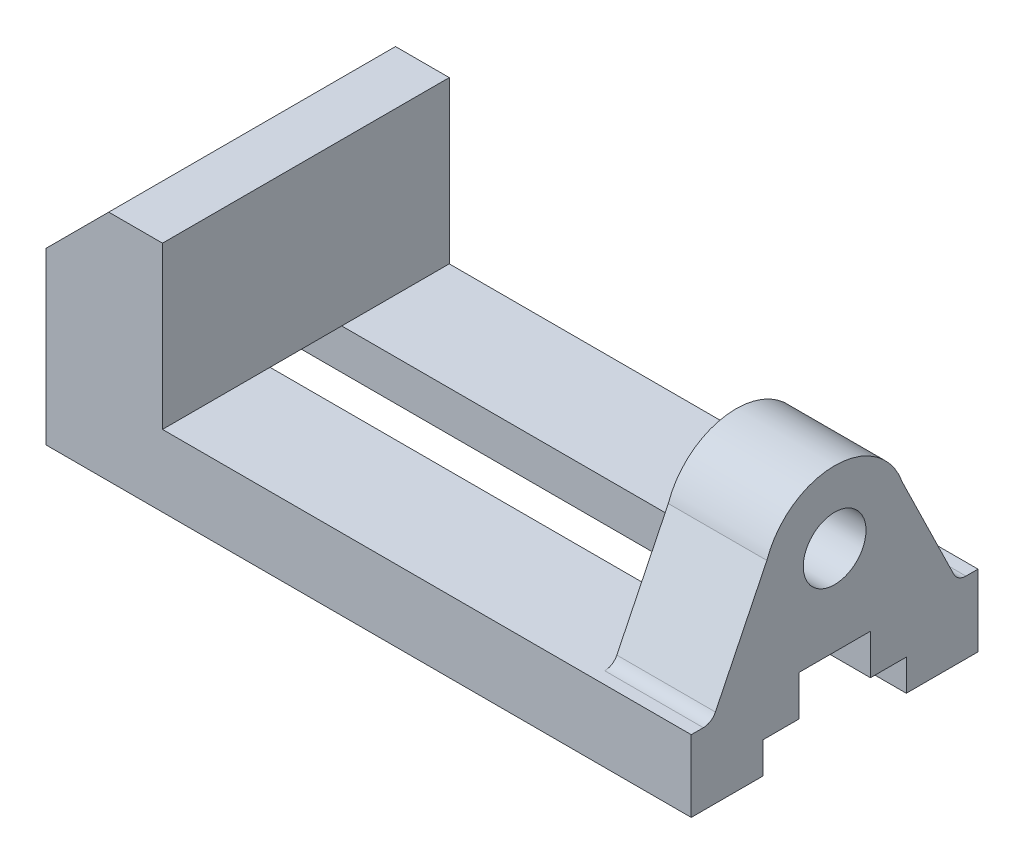
ISO-10303-21;
HEADER;
FILE_DESCRIPTION(('STEP AP214'),'2;1');
FILE_NAME('part.step','',(''),(''),'','','');
FILE_SCHEMA(('AUTOMOTIVE_DESIGN { 1 0 10303 214 1 1 1 1 }'));
ENDSEC;
DATA;
#1=APPLICATION_CONTEXT('core data for automotive mechanical design processes');
#2=APPLICATION_PROTOCOL_DEFINITION('international standard','automotive_design',2000,#1);
#3=PRODUCT_CONTEXT('',#1,'mechanical');
#4=PRODUCT('Part','Part','',(#3));
#5=PRODUCT_RELATED_PRODUCT_CATEGORY('part','',(#4));
#6=PRODUCT_DEFINITION_FORMATION('','',#4);
#7=PRODUCT_DEFINITION_CONTEXT('part definition',#1,'design');
#8=PRODUCT_DEFINITION('design','',#6,#7);
#9=PRODUCT_DEFINITION_SHAPE('','',#8);
#10=(LENGTH_UNIT() NAMED_UNIT(*) SI_UNIT(.MILLI.,.METRE.));
#11=(NAMED_UNIT(*) PLANE_ANGLE_UNIT() SI_UNIT($,.RADIAN.));
#12=(NAMED_UNIT(*) SI_UNIT($,.STERADIAN.) SOLID_ANGLE_UNIT());
#13=UNCERTAINTY_MEASURE_WITH_UNIT(LENGTH_MEASURE(1.E-05),#10,'distance_accuracy_value','');
#14=(GEOMETRIC_REPRESENTATION_CONTEXT(3) GLOBAL_UNCERTAINTY_ASSIGNED_CONTEXT((#13)) GLOBAL_UNIT_ASSIGNED_CONTEXT((#10,
#11,#12)) REPRESENTATION_CONTEXT('',''));
#15=CARTESIAN_POINT('',(0.,0.,0.));
#16=DIRECTION('',(0.,0.,1.));
#17=DIRECTION('',(1.,0.,0.));
#18=AXIS2_PLACEMENT_3D('',#15,#16,#17);
#19=CARTESIAN_POINT('',(71.2697768762677,16.,32.0551724137931));
#20=DIRECTION('',(-1.,0.,0.));
#21=DIRECTION('',(0.,0.,1.));
#22=AXIS2_PLACEMENT_3D('',#19,#20,#21);
#23=PLANE('',#22);
#24=DIRECTION('',(0.,0.,-1.));
#25=VECTOR('',#24,1.);
#26=CARTESIAN_POINT('',(71.2697768762677,16.,0.));
#27=LINE('',#26,#25);
#28=CARTESIAN_POINT('',(71.2697768762677,16.,-29.2462315949759));
#29=VERTEX_POINT('',#28);
#30=CARTESIAN_POINT('',(71.2697768762677,16.,-31.9448275862069));
#31=VERTEX_POINT('',#30);
#32=EDGE_CURVE('E248',#29,#31,#27,.T.);
#33=ORIENTED_EDGE('',*,*,#32,.F.);
#34=CARTESIAN_POINT('',(71.2697768762677,19.,-29.2462315949759));
#35=DIRECTION('',(-1.,0.,0.));
#36=DIRECTION('',(0.,0.,1.));
#37=AXIS2_PLACEMENT_3D('',#34,#35,#36);
#38=CIRCLE('',#37,3.);
#39=CARTESIAN_POINT('',(71.2697768762677,17.6848865596328,-26.5498494560784));
#40=VERTEX_POINT('',#39);
#41=EDGE_CURVE('E403',#29,#40,#38,.T.);
#42=ORIENTED_EDGE('',*,*,#41,.T.);
#43=DIRECTION('',(0.,0.89879404629917,0.438371146789073));
#44=VECTOR('',#43,1.);
#45=CARTESIAN_POINT('',(71.2697768762677,13.8592750436957,-28.4157248635937));
#46=LINE('',#45,#44);
#47=CARTESIAN_POINT('',(71.2697768762677,41.2315615862091,-15.0653686932474));
#48=VERTEX_POINT('',#47);
#49=EDGE_CURVE('E247',#40,#48,#46,.T.);
#50=ORIENTED_EDGE('',*,*,#49,.T.);
#51=CARTESIAN_POINT('',(71.2697768762677,36.,0.055172413793117));
#52=DIRECTION('',(1.,0.,0.));
#53=DIRECTION('',(0.,0.,-1.));
#54=AXIS2_PLACEMENT_3D('',#51,#52,#53);
#55=CIRCLE('',#54,16.);
#56=CARTESIAN_POINT('',(71.2697768762677,41.2315615862091,15.1757135208336));
#57=VERTEX_POINT('',#56);
#58=EDGE_CURVE('E260',#48,#57,#55,.T.);
#59=ORIENTED_EDGE('',*,*,#58,.T.);
#60=DIRECTION('',(0.,0.89879404629917,-0.438371146789073));
#61=VECTOR('',#60,1.);
#62=CARTESIAN_POINT('',(71.2697768762677,13.9027514990671,28.50486480706));
#63=LINE('',#62,#61);
#64=CARTESIAN_POINT('',(71.2697768762677,17.6848865596328,26.6601942836646));
#65=VERTEX_POINT('',#64);
#66=EDGE_CURVE('E254',#65,#57,#63,.T.);
#67=ORIENTED_EDGE('',*,*,#66,.F.);
#68=CARTESIAN_POINT('',(71.2697768762677,19.,29.3565764225621));
#69=DIRECTION('',(-1.,0.,0.));
#70=DIRECTION('',(0.,0.,1.));
#71=AXIS2_PLACEMENT_3D('',#68,#69,#70);
#72=CIRCLE('',#71,3.);
#73=CARTESIAN_POINT('',(71.2697768762677,16.,29.3565764225621));
#74=VERTEX_POINT('',#73);
#75=EDGE_CURVE('E48',#65,#74,#72,.T.);
#76=ORIENTED_EDGE('',*,*,#75,.T.);
#77=DIRECTION('',(0.,0.,1.));
#78=VECTOR('',#77,1.);
#79=CARTESIAN_POINT('',(71.2697768762677,16.,0.));
#80=LINE('',#79,#78);
#81=CARTESIAN_POINT('',(71.2697768762677,16.,32.0551724137931));
#82=VERTEX_POINT('',#81);
#83=EDGE_CURVE('E257',#74,#82,#80,.T.);
#84=ORIENTED_EDGE('',*,*,#83,.T.);
#85=DIRECTION('',(0.,-1.,0.));
#86=VECTOR('',#85,1.);
#87=CARTESIAN_POINT('',(71.2697768762677,16.,32.0551724137931));
#88=LINE('',#87,#86);
#89=CARTESIAN_POINT('',(71.2697768762677,0.,32.0551724137931));
#90=VERTEX_POINT('',#89);
#91=EDGE_CURVE('E354',#82,#90,#88,.T.);
#92=ORIENTED_EDGE('',*,*,#91,.T.);
#93=DIRECTION('',(0.,0.,-1.));
#94=VECTOR('',#93,1.);
#95=CARTESIAN_POINT('',(71.2697768762677,0.,32.0551724137931));
#96=LINE('',#95,#94);
#97=CARTESIAN_POINT('',(71.2697768762677,0.,16.0551724137931));
#98=VERTEX_POINT('',#97);
#99=EDGE_CURVE('E356',#90,#98,#96,.T.);
#100=ORIENTED_EDGE('',*,*,#99,.T.);
#101=DIRECTION('',(0.,-1.,0.));
#102=VECTOR('',#101,1.);
#103=CARTESIAN_POINT('',(71.2697768762677,0.,16.0551724137931));
#104=LINE('',#103,#102);
#105=CARTESIAN_POINT('',(71.2697768762677,7.,16.0551724137931));
#106=VERTEX_POINT('',#105);
#107=EDGE_CURVE('E374',#106,#98,#104,.T.);
#108=ORIENTED_EDGE('',*,*,#107,.F.);
#109=DIRECTION('',(0.,0.,1.));
#110=VECTOR('',#109,1.);
#111=CARTESIAN_POINT('',(71.2697768762677,7.,16.0551724137931));
#112=LINE('',#111,#110);
#113=CARTESIAN_POINT('',(71.2697768762677,7.,8.05517241379312));
#114=VERTEX_POINT('',#113);
#115=EDGE_CURVE('E371',#114,#106,#112,.T.);
#116=ORIENTED_EDGE('',*,*,#115,.F.);
#117=DIRECTION('',(0.,-1.,0.));
#118=VECTOR('',#117,1.);
#119=CARTESIAN_POINT('',(71.2697768762677,7.,8.05517241379312));
#120=LINE('',#119,#118);
#121=CARTESIAN_POINT('',(71.2697768762677,16.,8.05517241379312));
#122=VERTEX_POINT('',#121);
#123=EDGE_CURVE('E343',#122,#114,#120,.T.);
#124=ORIENTED_EDGE('',*,*,#123,.F.);
#125=DIRECTION('',(0.,0.,-1.));
#126=VECTOR('',#125,1.);
#127=CARTESIAN_POINT('',(71.2697768762677,16.,32.0551724137931));
#128=LINE('',#127,#126);
#129=CARTESIAN_POINT('',(71.2697768762677,16.,-7.94482758620688));
#130=VERTEX_POINT('',#129);
#131=EDGE_CURVE('E330',#122,#130,#128,.T.);
#132=ORIENTED_EDGE('',*,*,#131,.T.);
#133=DIRECTION('',(0.,1.,0.));
#134=VECTOR('',#133,1.);
#135=CARTESIAN_POINT('',(71.2697768762677,16.,-7.94482758620688));
#136=LINE('',#135,#134);
#137=CARTESIAN_POINT('',(71.2697768762677,7.,-7.94482758620688));
#138=VERTEX_POINT('',#137);
#139=EDGE_CURVE('E293',#138,#130,#136,.T.);
#140=ORIENTED_EDGE('',*,*,#139,.F.);
#141=DIRECTION('',(0.,0.,1.));
#142=VECTOR('',#141,1.);
#143=CARTESIAN_POINT('',(71.2697768762677,7.,-7.94482758620688));
#144=LINE('',#143,#142);
#145=CARTESIAN_POINT('',(71.2697768762677,7.,-15.9448275862069));
#146=VERTEX_POINT('',#145);
#147=EDGE_CURVE('E290',#146,#138,#144,.T.);
#148=ORIENTED_EDGE('',*,*,#147,.F.);
#149=DIRECTION('',(0.,1.,0.));
#150=VECTOR('',#149,1.);
#151=CARTESIAN_POINT('',(71.2697768762677,7.,-15.9448275862069));
#152=LINE('',#151,#150);
#153=CARTESIAN_POINT('',(71.2697768762677,0.,-15.9448275862069));
#154=VERTEX_POINT('',#153);
#155=EDGE_CURVE('E287',#154,#146,#152,.T.);
#156=ORIENTED_EDGE('',*,*,#155,.F.);
#157=DIRECTION('',(0.,0.,-1.));
#158=VECTOR('',#157,1.);
#159=CARTESIAN_POINT('',(71.2697768762677,0.,32.0551724137931));
#160=LINE('',#159,#158);
#161=CARTESIAN_POINT('',(71.2697768762677,0.,-31.9448275862069));
#162=VERTEX_POINT('',#161);
#163=EDGE_CURVE('E317',#154,#162,#160,.T.);
#164=ORIENTED_EDGE('',*,*,#163,.T.);
#165=DIRECTION('',(0.,-1.,0.));
#166=VECTOR('',#165,1.);
#167=CARTESIAN_POINT('',(71.2697768762677,52.,-31.9448275862069));
#168=LINE('',#167,#166);
#169=EDGE_CURVE('E337',#31,#162,#168,.T.);
#170=ORIENTED_EDGE('',*,*,#169,.F.);
#171=EDGE_LOOP('',(#33,#42,#50,#59,#67,#76,#84,#92,#100,#108,#116,#124,#132,#140,#148,#156,#164,#170));
#172=FACE_BOUND('',#171,.T.);
#173=CARTESIAN_POINT('',(71.2697768762677,36.,0.055172413793117));
#174=DIRECTION('',(1.,0.,0.));
#175=DIRECTION('',(0.,0.,-1.));
#176=AXIS2_PLACEMENT_3D('',#173,#174,#175);
#177=CIRCLE('',#176,6.99999999999999);
#178=CARTESIAN_POINT('',(71.2697768762677,36.,-6.94482758620687));
#179=VERTEX_POINT('',#178);
#180=EDGE_CURVE('E237',#179,#179,#177,.T.);
#181=ORIENTED_EDGE('',*,*,#180,.F.);
#182=EDGE_LOOP('',(#181));
#183=FACE_BOUND('',#182,.T.);
#184=ADVANCED_FACE('F40',(#172,#183),#23,.F.);
#185=CARTESIAN_POINT('',(49.2697768762677,52.,-31.9448275862069));
#186=DIRECTION('',(1.,0.,0.));
#187=DIRECTION('',(0.,0.,-1.));
#188=AXIS2_PLACEMENT_3D('',#185,#186,#187);
#189=PLANE('',#188);
#190=CARTESIAN_POINT('',(49.2697768762677,36.,0.055172413793117));
#191=DIRECTION('',(1.,0.,0.));
#192=DIRECTION('',(0.,0.,-1.));
#193=AXIS2_PLACEMENT_3D('',#190,#191,#192);
#194=CIRCLE('',#193,6.99999999999999);
#195=CARTESIAN_POINT('',(49.2697768762677,36.,-6.94482758620687));
#196=VERTEX_POINT('',#195);
#197=EDGE_CURVE('E240',#196,#196,#194,.T.);
#198=ORIENTED_EDGE('',*,*,#197,.T.);
#199=EDGE_LOOP('',(#198));
#200=FACE_BOUND('',#199,.T.);
#201=CARTESIAN_POINT('',(49.2697768762677,36.,0.055172413793117));
#202=DIRECTION('',(1.,0.,0.));
#203=DIRECTION('',(0.,0.,-1.));
#204=AXIS2_PLACEMENT_3D('',#201,#202,#203);
#205=CIRCLE('',#204,16.);
#206=CARTESIAN_POINT('',(49.2697768762677,41.2315615862091,15.1757135208336));
#207=VERTEX_POINT('',#206);
#208=CARTESIAN_POINT('',(49.2697768762677,41.2315615862091,-15.0653686932474));
#209=VERTEX_POINT('',#208);
#210=EDGE_CURVE('E250',#207,#209,#205,.F.);
#211=ORIENTED_EDGE('',*,*,#210,.T.);
#212=DIRECTION('',(0.,-0.898794046299169,-0.438371146789072));
#213=VECTOR('',#212,1.);
#214=CARTESIAN_POINT('',(49.2697768762677,13.8592750436957,-28.4157248635937));
#215=LINE('',#214,#213);
#216=CARTESIAN_POINT('',(49.2697768762677,17.6848865596328,-26.5498494560784));
#217=VERTEX_POINT('',#216);
#218=EDGE_CURVE('E244',#209,#217,#215,.T.);
#219=ORIENTED_EDGE('',*,*,#218,.T.);
#220=CARTESIAN_POINT('',(49.2697768762677,19.,-29.2462315949759));
#221=DIRECTION('',(1.,0.,0.));
#222=DIRECTION('',(0.,0.,-1.));
#223=AXIS2_PLACEMENT_3D('',#220,#221,#222);
#224=CIRCLE('',#223,3.);
#225=CARTESIAN_POINT('',(49.2697768762677,16.,-29.2462315949759));
#226=VERTEX_POINT('',#225);
#227=EDGE_CURVE('E405',#217,#226,#224,.T.);
#228=ORIENTED_EDGE('',*,*,#227,.T.);
#229=DIRECTION('',(0.,0.,1.));
#230=VECTOR('',#229,1.);
#231=CARTESIAN_POINT('',(49.2697768762677,16.,-31.9448275862069));
#232=LINE('',#231,#230);
#233=CARTESIAN_POINT('',(49.2697768762677,16.,-7.94482758620688));
#234=VERTEX_POINT('',#233);
#235=EDGE_CURVE('E335',#226,#234,#232,.T.);
#236=ORIENTED_EDGE('',*,*,#235,.T.);
#237=CARTESIAN_POINT('',(49.2697768762677,16.,8.05517241379312));
#238=VERTEX_POINT('',#237);
#239=EDGE_CURVE('E334',#234,#238,#232,.T.);
#240=ORIENTED_EDGE('',*,*,#239,.T.);
#241=CARTESIAN_POINT('',(49.2697768762677,16.,29.3565764225621));
#242=VERTEX_POINT('',#241);
#243=EDGE_CURVE('E54',#238,#242,#232,.T.);
#244=ORIENTED_EDGE('',*,*,#243,.T.);
#245=CARTESIAN_POINT('',(49.2697768762677,19.,29.3565764225621));
#246=DIRECTION('',(1.,0.,0.));
#247=DIRECTION('',(0.,0.,-1.));
#248=AXIS2_PLACEMENT_3D('',#245,#246,#247);
#249=CIRCLE('',#248,3.);
#250=CARTESIAN_POINT('',(49.2697768762677,17.6848865596328,26.6601942836646));
#251=VERTEX_POINT('',#250);
#252=EDGE_CURVE('E11',#242,#251,#249,.T.);
#253=ORIENTED_EDGE('',*,*,#252,.T.);
#254=DIRECTION('',(0.,-0.898794046299169,0.438371146789072));
#255=VECTOR('',#254,1.);
#256=CARTESIAN_POINT('',(49.2697768762677,13.9027514990671,28.50486480706));
#257=LINE('',#256,#255);
#258=EDGE_CURVE('E256',#207,#251,#257,.T.);
#259=ORIENTED_EDGE('',*,*,#258,.F.);
#260=EDGE_LOOP('',(#211,#219,#228,#236,#240,#244,#253,#259));
#261=FACE_BOUND('',#260,.T.);
#262=ADVANCED_FACE('F409',(#200,#261),#189,.F.);
#263=CARTESIAN_POINT('',(-72.7302231237323,16.,32.0551724137931));
#264=DIRECTION('',(0.,0.,-1.));
#265=DIRECTION('',(-1.,0.,0.));
#266=AXIS2_PLACEMENT_3D('',#263,#264,#265);
#267=PLANE('',#266);
#268=ORIENTED_EDGE('',*,*,#91,.F.);
#269=DIRECTION('',(1.,0.,0.));
#270=VECTOR('',#269,1.);
#271=CARTESIAN_POINT('',(-72.7302231237323,16.,32.0551724137931));
#272=LINE('',#271,#270);
#273=CARTESIAN_POINT('',(-46.7302231237323,16.,32.0551724137931));
#274=VERTEX_POINT('',#273);
#275=EDGE_CURVE('E350',#274,#82,#272,.T.);
#276=ORIENTED_EDGE('',*,*,#275,.F.);
#277=DIRECTION('',(0.,-1.,0.));
#278=VECTOR('',#277,1.);
#279=CARTESIAN_POINT('',(-46.7302231237323,52.,32.0551724137931));
#280=LINE('',#279,#278);
#281=CARTESIAN_POINT('',(-46.7302231237323,52.,32.0551724137931));
#282=VERTEX_POINT('',#281);
#283=EDGE_CURVE('E285',#282,#274,#280,.T.);
#284=ORIENTED_EDGE('',*,*,#283,.F.);
#285=DIRECTION('',(1.,0.,0.));
#286=VECTOR('',#285,1.);
#287=CARTESIAN_POINT('',(-46.7302231237323,52.,32.0551724137931));
#288=LINE('',#287,#286);
#289=CARTESIAN_POINT('',(-58.7302231237323,52.,32.0551724137931));
#290=VERTEX_POINT('',#289);
#291=EDGE_CURVE('E269',#290,#282,#288,.T.);
#292=ORIENTED_EDGE('',*,*,#291,.F.);
#293=DIRECTION('',(0.707106781186546,0.707106781186549,0.));
#294=VECTOR('',#293,1.);
#295=CARTESIAN_POINT('',(-58.7302231237323,52.,32.0551724137931));
#296=LINE('',#295,#294);
#297=CARTESIAN_POINT('',(-72.7302231237323,37.9999999999999,32.0551724137931));
#298=VERTEX_POINT('',#297);
#299=EDGE_CURVE('E387',#290,#298,#296,.F.);
#300=ORIENTED_EDGE('',*,*,#299,.T.);
#301=DIRECTION('',(0.,-1.,0.));
#302=VECTOR('',#301,1.);
#303=CARTESIAN_POINT('',(-72.7302231237323,16.,32.0551724137931));
#304=LINE('',#303,#302);
#305=CARTESIAN_POINT('',(-72.7302231237323,0.,32.0551724137931));
#306=VERTEX_POINT('',#305);
#307=EDGE_CURVE('E351',#298,#306,#304,.T.);
#308=ORIENTED_EDGE('',*,*,#307,.T.);
#309=DIRECTION('',(1.,0.,0.));
#310=VECTOR('',#309,1.);
#311=CARTESIAN_POINT('',(-72.7302231237323,0.,32.0551724137931));
#312=LINE('',#311,#310);
#313=EDGE_CURVE('E349',#306,#90,#312,.T.);
#314=ORIENTED_EDGE('',*,*,#313,.T.);
#315=EDGE_LOOP('',(#268,#276,#284,#292,#300,#308,#314));
#316=FACE_BOUND('',#315,.T.);
#317=ADVANCED_FACE('F483',(#316),#267,.F.);
#318=CARTESIAN_POINT('',(0.,16.,0.));
#319=DIRECTION('',(0.,1.,0.));
#320=DIRECTION('',(0.,0.,1.));
#321=AXIS2_PLACEMENT_3D('',#318,#319,#320);
#322=PLANE('',#321);
#323=ORIENTED_EDGE('',*,*,#83,.F.);
#324=DIRECTION('',(1.,0.,0.));
#325=VECTOR('',#324,1.);
#326=CARTESIAN_POINT('',(0.,16.,29.3565764225621));
#327=LINE('',#326,#325);
#328=EDGE_CURVE('E401',#74,#242,#327,.F.);
#329=ORIENTED_EDGE('',*,*,#328,.T.);
#330=ORIENTED_EDGE('',*,*,#243,.F.);
#331=DIRECTION('',(1.,0.,0.));
#332=VECTOR('',#331,1.);
#333=CARTESIAN_POINT('',(0.,16.,8.05517241379312));
#334=LINE('',#333,#332);
#335=CARTESIAN_POINT('',(-46.7302231237323,16.,8.05517241379312));
#336=VERTEX_POINT('',#335);
#337=EDGE_CURVE('E344',#336,#238,#334,.T.);
#338=ORIENTED_EDGE('',*,*,#337,.F.);
#339=DIRECTION('',(0.,0.,-1.));
#340=VECTOR('',#339,1.);
#341=CARTESIAN_POINT('',(-46.7302231237323,16.,-31.9448275862069));
#342=LINE('',#341,#340);
#343=EDGE_CURVE('E272',#274,#336,#342,.T.);
#344=ORIENTED_EDGE('',*,*,#343,.F.);
#345=ORIENTED_EDGE('',*,*,#275,.T.);
#346=EDGE_LOOP('',(#323,#329,#330,#338,#344,#345));
#347=FACE_BOUND('',#346,.T.);
#348=ADVANCED_FACE('F455',(#347),#322,.T.);
#349=CARTESIAN_POINT('',(0.,16.,0.));
#350=DIRECTION('',(0.,1.,0.));
#351=DIRECTION('',(0.,0.,1.));
#352=AXIS2_PLACEMENT_3D('',#349,#350,#351);
#353=PLANE('',#352);
#354=ORIENTED_EDGE('',*,*,#235,.F.);
#355=DIRECTION('',(1.,0.,0.));
#356=VECTOR('',#355,1.);
#357=CARTESIAN_POINT('',(71.2697768762677,16.,-29.2462315949759));
#358=LINE('',#357,#356);
#359=EDGE_CURVE('E393',#226,#29,#358,.T.);
#360=ORIENTED_EDGE('',*,*,#359,.T.);
#361=ORIENTED_EDGE('',*,*,#32,.T.);
#362=DIRECTION('',(-1.,0.,0.));
#363=VECTOR('',#362,1.);
#364=CARTESIAN_POINT('',(71.2697768762677,16.,-31.9448275862069));
#365=LINE('',#364,#363);
#366=CARTESIAN_POINT('',(-46.7302231237323,16.,-31.9448275862069));
#367=VERTEX_POINT('',#366);
#368=EDGE_CURVE('E310',#31,#367,#365,.T.);
#369=ORIENTED_EDGE('',*,*,#368,.T.);
#370=CARTESIAN_POINT('',(-46.7302231237323,16.,-7.94482758620688));
#371=VERTEX_POINT('',#370);
#372=EDGE_CURVE('E280',#371,#367,#342,.T.);
#373=ORIENTED_EDGE('',*,*,#372,.F.);
#374=DIRECTION('',(-1.,0.,0.));
#375=VECTOR('',#374,1.);
#376=CARTESIAN_POINT('',(0.,16.,-7.94482758620688));
#377=LINE('',#376,#375);
#378=EDGE_CURVE('E331',#234,#371,#377,.T.);
#379=ORIENTED_EDGE('',*,*,#378,.F.);
#380=EDGE_LOOP('',(#354,#360,#361,#369,#373,#379));
#381=FACE_BOUND('',#380,.T.);
#382=ADVANCED_FACE('F417',(#381),#353,.T.);
#383=CARTESIAN_POINT('',(0.,16.,0.));
#384=DIRECTION('',(0.,1.,0.));
#385=DIRECTION('',(0.,0.,1.));
#386=AXIS2_PLACEMENT_3D('',#383,#384,#385);
#387=PLANE('',#386);
#388=EDGE_CURVE('E327',#130,#234,#377,.T.);
#389=ORIENTED_EDGE('',*,*,#388,.F.);
#390=ORIENTED_EDGE('',*,*,#131,.F.);
#391=EDGE_CURVE('E345',#238,#122,#334,.T.);
#392=ORIENTED_EDGE('',*,*,#391,.F.);
#393=ORIENTED_EDGE('',*,*,#239,.F.);
#394=EDGE_LOOP('',(#389,#390,#392,#393));
#395=FACE_BOUND('',#394,.T.);
#396=ADVANCED_FACE('F442',(#395),#387,.F.);
#397=CARTESIAN_POINT('',(-72.7302231237323,16.,-31.9448275862069));
#398=DIRECTION('',(1.,0.,0.));
#399=DIRECTION('',(0.,0.,-1.));
#400=AXIS2_PLACEMENT_3D('',#397,#398,#399);
#401=PLANE('',#400);
#402=ORIENTED_EDGE('',*,*,#307,.F.);
#403=DIRECTION('',(0.,0.,-1.));
#404=VECTOR('',#403,1.);
#405=CARTESIAN_POINT('',(-72.7302231237323,37.9999999999999,-31.9448275862069));
#406=LINE('',#405,#404);
#407=CARTESIAN_POINT('',(-72.7302231237323,37.9999999999999,-31.9448275862069));
#408=VERTEX_POINT('',#407);
#409=EDGE_CURVE('E389',#298,#408,#406,.T.);
#410=ORIENTED_EDGE('',*,*,#409,.T.);
#411=DIRECTION('',(0.,-1.,0.));
#412=VECTOR('',#411,1.);
#413=CARTESIAN_POINT('',(-72.7302231237323,16.,-31.9448275862069));
#414=LINE('',#413,#412);
#415=CARTESIAN_POINT('',(-72.7302231237323,0.,-31.9448275862069));
#416=VERTEX_POINT('',#415);
#417=EDGE_CURVE('E313',#408,#416,#414,.T.);
#418=ORIENTED_EDGE('',*,*,#417,.T.);
#419=DIRECTION('',(0.,0.,1.));
#420=VECTOR('',#419,1.);
#421=CARTESIAN_POINT('',(-72.7302231237323,0.,-31.9448275862069));
#422=LINE('',#421,#420);
#423=CARTESIAN_POINT('',(-72.7302231237323,0.,-15.9448275862069));
#424=VERTEX_POINT('',#423);
#425=EDGE_CURVE('E309',#416,#424,#422,.T.);
#426=ORIENTED_EDGE('',*,*,#425,.T.);
#427=DIRECTION('',(0.,1.,0.));
#428=VECTOR('',#427,1.);
#429=CARTESIAN_POINT('',(-72.7302231237323,16.,-15.9448275862069));
#430=LINE('',#429,#428);
#431=CARTESIAN_POINT('',(-72.7302231237323,7.,-15.9448275862069));
#432=VERTEX_POINT('',#431);
#433=EDGE_CURVE('E299',#424,#432,#430,.T.);
#434=ORIENTED_EDGE('',*,*,#433,.T.);
#435=DIRECTION('',(0.,0.,1.));
#436=VECTOR('',#435,1.);
#437=CARTESIAN_POINT('',(-72.7302231237323,7.,-31.9448275862069));
#438=LINE('',#437,#436);
#439=CARTESIAN_POINT('',(-72.7302231237323,7.,-7.94482758620688));
#440=VERTEX_POINT('',#439);
#441=EDGE_CURVE('E306',#432,#440,#438,.T.);
#442=ORIENTED_EDGE('',*,*,#441,.T.);
#443=DIRECTION('',(0.,1.,0.));
#444=VECTOR('',#443,1.);
#445=CARTESIAN_POINT('',(-72.7302231237323,16.,-7.94482758620688));
#446=LINE('',#445,#444);
#447=CARTESIAN_POINT('',(-72.7302231237323,16.,-7.94482758620688));
#448=VERTEX_POINT('',#447);
#449=EDGE_CURVE('E303',#440,#448,#446,.T.);
#450=ORIENTED_EDGE('',*,*,#449,.T.);
#451=DIRECTION('',(0.,0.,1.));
#452=VECTOR('',#451,1.);
#453=CARTESIAN_POINT('',(-72.7302231237323,16.,32.0551724137931));
#454=LINE('',#453,#452);
#455=CARTESIAN_POINT('',(-72.7302231237323,16.,8.05517241379312));
#456=VERTEX_POINT('',#455);
#457=EDGE_CURVE('E266',#448,#456,#454,.T.);
#458=ORIENTED_EDGE('',*,*,#457,.T.);
#459=DIRECTION('',(0.,-1.,0.));
#460=VECTOR('',#459,1.);
#461=CARTESIAN_POINT('',(-72.7302231237323,16.,8.05517241379312));
#462=LINE('',#461,#460);
#463=CARTESIAN_POINT('',(-72.7302231237323,7.,8.05517241379312));
#464=VERTEX_POINT('',#463);
#465=EDGE_CURVE('E364',#456,#464,#462,.T.);
#466=ORIENTED_EDGE('',*,*,#465,.T.);
#467=DIRECTION('',(0.,0.,1.));
#468=VECTOR('',#467,1.);
#469=CARTESIAN_POINT('',(-72.7302231237323,7.,-31.9448275862069));
#470=LINE('',#469,#468);
#471=CARTESIAN_POINT('',(-72.7302231237323,7.,16.0551724137931));
#472=VERTEX_POINT('',#471);
#473=EDGE_CURVE('E339',#464,#472,#470,.T.);
#474=ORIENTED_EDGE('',*,*,#473,.T.);
#475=DIRECTION('',(0.,-1.,0.));
#476=VECTOR('',#475,1.);
#477=CARTESIAN_POINT('',(-72.7302231237323,16.,16.0551724137931));
#478=LINE('',#477,#476);
#479=CARTESIAN_POINT('',(-72.7302231237323,0.,16.0551724137931));
#480=VERTEX_POINT('',#479);
#481=EDGE_CURVE('E363',#472,#480,#478,.T.);
#482=ORIENTED_EDGE('',*,*,#481,.T.);
#483=DIRECTION('',(0.,0.,1.));
#484=VECTOR('',#483,1.);
#485=CARTESIAN_POINT('',(-72.7302231237323,0.,-31.9448275862069));
#486=LINE('',#485,#484);
#487=EDGE_CURVE('E367',#480,#306,#486,.T.);
#488=ORIENTED_EDGE('',*,*,#487,.T.);
#489=EDGE_LOOP('',(#402,#410,#418,#426,#434,#442,#450,#458,#466,#474,#482,#488));
#490=FACE_BOUND('',#489,.T.);
#491=ADVANCED_FACE('F489',(#490),#401,.F.);
#492=CARTESIAN_POINT('',(0.,0.,0.));
#493=DIRECTION('',(0.,1.,0.));
#494=DIRECTION('',(0.,0.,1.));
#495=AXIS2_PLACEMENT_3D('',#492,#493,#494);
#496=PLANE('',#495);
#497=CARTESIAN_POINT('',(-36.7302231237323,0.,22.0551724137931));
#498=DIRECTION('',(0.,-1.,0.));
#499=DIRECTION('',(0.,0.,-1.));
#500=AXIS2_PLACEMENT_3D('',#497,#498,#499);
#501=CIRCLE('',#500,2.49999999999999);
#502=CARTESIAN_POINT('',(-36.7302231237323,0.,19.5551724137931));
#503=VERTEX_POINT('',#502);
#504=EDGE_CURVE('E214',#503,#503,#501,.T.);
#505=ORIENTED_EDGE('',*,*,#504,.F.);
#506=EDGE_LOOP('',(#505));
#507=FACE_BOUND('',#506,.T.);
#508=CARTESIAN_POINT('',(35.2697768762677,0.,22.0551724137931));
#509=DIRECTION('',(0.,-1.,0.));
#510=DIRECTION('',(0.,0.,-1.));
#511=AXIS2_PLACEMENT_3D('',#508,#509,#510);
#512=CIRCLE('',#511,2.49999999999999);
#513=CARTESIAN_POINT('',(35.2697768762677,0.,19.5551724137931));
#514=VERTEX_POINT('',#513);
#515=EDGE_CURVE('E225',#514,#514,#512,.T.);
#516=ORIENTED_EDGE('',*,*,#515,.F.);
#517=EDGE_LOOP('',(#516));
#518=FACE_BOUND('',#517,.T.);
#519=ORIENTED_EDGE('',*,*,#487,.F.);
#520=DIRECTION('',(1.,0.,0.));
#521=VECTOR('',#520,1.);
#522=CARTESIAN_POINT('',(0.,0.,16.0551724137931));
#523=LINE('',#522,#521);
#524=EDGE_CURVE('E346',#480,#98,#523,.T.);
#525=ORIENTED_EDGE('',*,*,#524,.T.);
#526=ORIENTED_EDGE('',*,*,#99,.F.);
#527=ORIENTED_EDGE('',*,*,#313,.F.);
#528=EDGE_LOOP('',(#519,#525,#526,#527));
#529=FACE_BOUND('',#528,.T.);
#530=ADVANCED_FACE('F492',(#507,#518,#529),#496,.F.);
#531=CARTESIAN_POINT('',(-115.730223123732,7.,16.0551724137931));
#532=DIRECTION('',(0.,1.,0.));
#533=DIRECTION('',(0.,0.,1.));
#534=AXIS2_PLACEMENT_3D('',#531,#532,#533);
#535=PLANE('',#534);
#536=DIRECTION('',(1.,0.,0.));
#537=VECTOR('',#536,1.);
#538=CARTESIAN_POINT('',(-115.730223123732,7.,8.05517241379312));
#539=LINE('',#538,#537);
#540=EDGE_CURVE('E353',#464,#114,#539,.T.);
#541=ORIENTED_EDGE('',*,*,#540,.T.);
#542=ORIENTED_EDGE('',*,*,#115,.T.);
#543=DIRECTION('',(1.,0.,0.));
#544=VECTOR('',#543,1.);
#545=CARTESIAN_POINT('',(-115.730223123732,7.,16.0551724137931));
#546=LINE('',#545,#544);
#547=EDGE_CURVE('E372',#472,#106,#546,.T.);
#548=ORIENTED_EDGE('',*,*,#547,.F.);
#549=ORIENTED_EDGE('',*,*,#473,.F.);
#550=EDGE_LOOP('',(#541,#542,#548,#549));
#551=FACE_BOUND('',#550,.T.);
#552=ADVANCED_FACE('F551',(#551),#535,.F.);
#553=CARTESIAN_POINT('',(-115.730223123732,7.,8.05517241379312));
#554=DIRECTION('',(0.,0.,1.));
#555=DIRECTION('',(1.,0.,0.));
#556=AXIS2_PLACEMENT_3D('',#553,#554,#555);
#557=PLANE('',#556);
#558=EDGE_CURVE('E340',#456,#336,#334,.T.);
#559=ORIENTED_EDGE('',*,*,#558,.T.);
#560=ORIENTED_EDGE('',*,*,#337,.T.);
#561=ORIENTED_EDGE('',*,*,#391,.T.);
#562=ORIENTED_EDGE('',*,*,#123,.T.);
#563=ORIENTED_EDGE('',*,*,#540,.F.);
#564=ORIENTED_EDGE('',*,*,#465,.F.);
#565=EDGE_LOOP('',(#559,#560,#561,#562,#563,#564));
#566=FACE_BOUND('',#565,.T.);
#567=ADVANCED_FACE('F450',(#566),#557,.F.);
#568=CARTESIAN_POINT('',(-115.730223123732,0.,16.0551724137931));
#569=DIRECTION('',(0.,0.,1.));
#570=DIRECTION('',(1.,0.,0.));
#571=AXIS2_PLACEMENT_3D('',#568,#569,#570);
#572=PLANE('',#571);
#573=ORIENTED_EDGE('',*,*,#547,.T.);
#574=ORIENTED_EDGE('',*,*,#107,.T.);
#575=ORIENTED_EDGE('',*,*,#524,.F.);
#576=ORIENTED_EDGE('',*,*,#481,.F.);
#577=EDGE_LOOP('',(#573,#574,#575,#576));
#578=FACE_BOUND('',#577,.T.);
#579=ADVANCED_FACE('F542',(#578),#572,.F.);
#580=CARTESIAN_POINT('',(71.2697768762677,52.,-31.9448275862069));
#581=DIRECTION('',(0.,0.,1.));
#582=DIRECTION('',(1.,0.,0.));
#583=AXIS2_PLACEMENT_3D('',#580,#581,#582);
#584=PLANE('',#583);
#585=ORIENTED_EDGE('',*,*,#368,.F.);
#586=ORIENTED_EDGE('',*,*,#169,.T.);
#587=DIRECTION('',(-1.,0.,0.));
#588=VECTOR('',#587,1.);
#589=CARTESIAN_POINT('',(71.2697768762677,0.,-31.9448275862069));
#590=LINE('',#589,#588);
#591=EDGE_CURVE('E314',#162,#416,#590,.T.);
#592=ORIENTED_EDGE('',*,*,#591,.T.);
#593=ORIENTED_EDGE('',*,*,#417,.F.);
#594=DIRECTION('',(-0.707106781186546,-0.707106781186549,0.));
#595=VECTOR('',#594,1.);
#596=CARTESIAN_POINT('',(-58.7302231237323,52.,-31.9448275862069));
#597=LINE('',#596,#595);
#598=CARTESIAN_POINT('',(-58.7302231237323,52.,-31.9448275862069));
#599=VERTEX_POINT('',#598);
#600=EDGE_CURVE('E391',#408,#599,#597,.F.);
#601=ORIENTED_EDGE('',*,*,#600,.T.);
#602=DIRECTION('',(-1.,0.,0.));
#603=VECTOR('',#602,1.);
#604=CARTESIAN_POINT('',(-72.7302231237323,52.,-31.9448275862069));
#605=LINE('',#604,#603);
#606=CARTESIAN_POINT('',(-46.7302231237323,52.,-31.9448275862069));
#607=VERTEX_POINT('',#606);
#608=EDGE_CURVE('E274',#607,#599,#605,.T.);
#609=ORIENTED_EDGE('',*,*,#608,.F.);
#610=DIRECTION('',(0.,-1.,0.));
#611=VECTOR('',#610,1.);
#612=CARTESIAN_POINT('',(-46.7302231237323,52.,-31.9448275862069));
#613=LINE('',#612,#611);
#614=EDGE_CURVE('E277',#607,#367,#613,.T.);
#615=ORIENTED_EDGE('',*,*,#614,.T.);
#616=EDGE_LOOP('',(#585,#586,#592,#593,#601,#609,#615));
#617=FACE_BOUND('',#616,.T.);
#618=ADVANCED_FACE('F427',(#617),#584,.F.);
#619=CARTESIAN_POINT('',(0.,0.,0.));
#620=DIRECTION('',(0.,1.,0.));
#621=DIRECTION('',(0.,0.,1.));
#622=AXIS2_PLACEMENT_3D('',#619,#620,#621);
#623=PLANE('',#622);
#624=CARTESIAN_POINT('',(-36.7302231237323,0.,-23.0862560147497));
#625=DIRECTION('',(0.,-1.,0.));
#626=DIRECTION('',(0.,0.,-1.));
#627=AXIS2_PLACEMENT_3D('',#624,#625,#626);
#628=CIRCLE('',#627,2.49999999999999);
#629=CARTESIAN_POINT('',(-36.7302231237323,0.,-25.5862560147497));
#630=VERTEX_POINT('',#629);
#631=EDGE_CURVE('E215',#630,#630,#628,.T.);
#632=ORIENTED_EDGE('',*,*,#631,.F.);
#633=EDGE_LOOP('',(#632));
#634=FACE_BOUND('',#633,.T.);
#635=CARTESIAN_POINT('',(35.2697768762677,0.,-21.9448275862069));
#636=DIRECTION('',(0.,-1.,0.));
#637=DIRECTION('',(0.,0.,-1.));
#638=AXIS2_PLACEMENT_3D('',#635,#636,#637);
#639=CIRCLE('',#638,2.49999999999999);
#640=CARTESIAN_POINT('',(35.2697768762677,0.,-24.4448275862069));
#641=VERTEX_POINT('',#640);
#642=EDGE_CURVE('E231',#641,#641,#639,.T.);
#643=ORIENTED_EDGE('',*,*,#642,.F.);
#644=EDGE_LOOP('',(#643));
#645=FACE_BOUND('',#644,.T.);
#646=ORIENTED_EDGE('',*,*,#163,.F.);
#647=DIRECTION('',(-1.,0.,0.));
#648=VECTOR('',#647,1.);
#649=CARTESIAN_POINT('',(0.,0.,-15.9448275862069));
#650=LINE('',#649,#648);
#651=EDGE_CURVE('E323',#154,#424,#650,.T.);
#652=ORIENTED_EDGE('',*,*,#651,.T.);
#653=ORIENTED_EDGE('',*,*,#425,.F.);
#654=ORIENTED_EDGE('',*,*,#591,.F.);
#655=EDGE_LOOP('',(#646,#652,#653,#654));
#656=FACE_BOUND('',#655,.T.);
#657=ADVANCED_FACE('F526',(#634,#645,#656),#623,.F.);
#658=CARTESIAN_POINT('',(-115.730223123732,16.,-7.94482758620688));
#659=DIRECTION('',(0.,0.,-1.));
#660=DIRECTION('',(-1.,0.,0.));
#661=AXIS2_PLACEMENT_3D('',#658,#659,#660);
#662=PLANE('',#661);
#663=DIRECTION('',(1.,0.,0.));
#664=VECTOR('',#663,1.);
#665=CARTESIAN_POINT('',(-115.730223123732,7.,-7.94482758620688));
#666=LINE('',#665,#664);
#667=EDGE_CURVE('E297',#440,#138,#666,.T.);
#668=ORIENTED_EDGE('',*,*,#667,.T.);
#669=ORIENTED_EDGE('',*,*,#139,.T.);
#670=ORIENTED_EDGE('',*,*,#388,.T.);
#671=ORIENTED_EDGE('',*,*,#378,.T.);
#672=EDGE_CURVE('E326',#371,#448,#377,.T.);
#673=ORIENTED_EDGE('',*,*,#672,.T.);
#674=ORIENTED_EDGE('',*,*,#449,.F.);
#675=EDGE_LOOP('',(#668,#669,#670,#671,#673,#674));
#676=FACE_BOUND('',#675,.T.);
#677=ADVANCED_FACE('F438',(#676),#662,.F.);
#678=CARTESIAN_POINT('',(-115.730223123732,7.,-15.9448275862069));
#679=DIRECTION('',(0.,0.,-1.));
#680=DIRECTION('',(-1.,0.,0.));
#681=AXIS2_PLACEMENT_3D('',#678,#679,#680);
#682=PLANE('',#681);
#683=ORIENTED_EDGE('',*,*,#651,.F.);
#684=ORIENTED_EDGE('',*,*,#155,.T.);
#685=DIRECTION('',(1.,0.,0.));
#686=VECTOR('',#685,1.);
#687=CARTESIAN_POINT('',(-115.730223123732,7.,-15.9448275862069));
#688=LINE('',#687,#686);
#689=EDGE_CURVE('E296',#432,#146,#688,.T.);
#690=ORIENTED_EDGE('',*,*,#689,.F.);
#691=ORIENTED_EDGE('',*,*,#433,.F.);
#692=EDGE_LOOP('',(#683,#684,#690,#691));
#693=FACE_BOUND('',#692,.T.);
#694=ADVANCED_FACE('F525',(#693),#682,.F.);
#695=CARTESIAN_POINT('',(-115.730223123732,7.,-7.94482758620688));
#696=DIRECTION('',(0.,1.,0.));
#697=DIRECTION('',(0.,0.,1.));
#698=AXIS2_PLACEMENT_3D('',#695,#696,#697);
#699=PLANE('',#698);
#700=ORIENTED_EDGE('',*,*,#689,.T.);
#701=ORIENTED_EDGE('',*,*,#147,.T.);
#702=ORIENTED_EDGE('',*,*,#667,.F.);
#703=ORIENTED_EDGE('',*,*,#441,.F.);
#704=EDGE_LOOP('',(#700,#701,#702,#703));
#705=FACE_BOUND('',#704,.T.);
#706=ADVANCED_FACE('F519',(#705),#699,.F.);
#707=CARTESIAN_POINT('',(0.,16.,0.));
#708=DIRECTION('',(0.,-1.,0.));
#709=DIRECTION('',(0.,0.,-1.));
#710=AXIS2_PLACEMENT_3D('',#707,#708,#709);
#711=PLANE('',#710);
#712=ORIENTED_EDGE('',*,*,#558,.F.);
#713=ORIENTED_EDGE('',*,*,#457,.F.);
#714=ORIENTED_EDGE('',*,*,#672,.F.);
#715=EDGE_CURVE('E282',#336,#371,#342,.T.);
#716=ORIENTED_EDGE('',*,*,#715,.F.);
#717=EDGE_LOOP('',(#712,#713,#714,#716));
#718=FACE_BOUND('',#717,.T.);
#719=ADVANCED_FACE('F514',(#718),#711,.T.);
#720=CARTESIAN_POINT('',(-46.7302231237323,52.,-31.9448275862069));
#721=DIRECTION('',(-1.,0.,0.));
#722=DIRECTION('',(0.,0.,1.));
#723=AXIS2_PLACEMENT_3D('',#720,#721,#722);
#724=PLANE('',#723);
#725=ORIENTED_EDGE('',*,*,#343,.T.);
#726=ORIENTED_EDGE('',*,*,#715,.T.);
#727=ORIENTED_EDGE('',*,*,#372,.T.);
#728=ORIENTED_EDGE('',*,*,#614,.F.);
#729=DIRECTION('',(0.,0.,-1.));
#730=VECTOR('',#729,1.);
#731=CARTESIAN_POINT('',(-46.7302231237323,52.,-31.9448275862069));
#732=LINE('',#731,#730);
#733=EDGE_CURVE('E271',#282,#607,#732,.T.);
#734=ORIENTED_EDGE('',*,*,#733,.F.);
#735=ORIENTED_EDGE('',*,*,#283,.T.);
#736=EDGE_LOOP('',(#725,#726,#727,#728,#734,#735));
#737=FACE_BOUND('',#736,.T.);
#738=ADVANCED_FACE('F503',(#737),#724,.F.);
#739=CARTESIAN_POINT('',(0.,52.,0.));
#740=DIRECTION('',(0.,-1.,0.));
#741=DIRECTION('',(0.,0.,-1.));
#742=AXIS2_PLACEMENT_3D('',#739,#740,#741);
#743=PLANE('',#742);
#744=ORIENTED_EDGE('',*,*,#608,.T.);
#745=DIRECTION('',(0.,0.,1.));
#746=VECTOR('',#745,1.);
#747=CARTESIAN_POINT('',(-58.7302231237323,52.,0.));
#748=LINE('',#747,#746);
#749=EDGE_CURVE('E384',#599,#290,#748,.T.);
#750=ORIENTED_EDGE('',*,*,#749,.T.);
#751=ORIENTED_EDGE('',*,*,#291,.T.);
#752=ORIENTED_EDGE('',*,*,#733,.T.);
#753=EDGE_LOOP('',(#744,#750,#751,#752));
#754=FACE_BOUND('',#753,.T.);
#755=ADVANCED_FACE('F496',(#754),#743,.F.);
#756=CARTESIAN_POINT('',(-58.7302231237323,52.,0.));
#757=DIRECTION('',(0.707106781186549,-0.707106781186546,0.));
#758=DIRECTION('',(0.,0.,1.));
#759=AXIS2_PLACEMENT_3D('',#756,#757,#758);
#760=PLANE('',#759);
#761=ORIENTED_EDGE('',*,*,#600,.F.);
#762=ORIENTED_EDGE('',*,*,#409,.F.);
#763=ORIENTED_EDGE('',*,*,#299,.F.);
#764=ORIENTED_EDGE('',*,*,#749,.F.);
#765=EDGE_LOOP('',(#761,#762,#763,#764));
#766=FACE_BOUND('',#765,.T.);
#767=ADVANCED_FACE('F494',(#766),#760,.F.);
#768=CARTESIAN_POINT('',(-72.7312231237323,36.,0.055172413793117));
#769=DIRECTION('',(1.,0.,0.));
#770=DIRECTION('',(0.,0.,-1.));
#771=AXIS2_PLACEMENT_3D('',#768,#769,#770);
#772=CYLINDRICAL_SURFACE('',#771,16.);
#773=DIRECTION('',(1.,0.,0.));
#774=VECTOR('',#773,1.);
#775=CARTESIAN_POINT('',(-72.7312231237323,41.2315615862091,15.1757135208336));
#776=LINE('',#775,#774);
#777=EDGE_CURVE('E259',#207,#57,#776,.T.);
#778=ORIENTED_EDGE('',*,*,#777,.T.);
#779=ORIENTED_EDGE('',*,*,#58,.F.);
#780=DIRECTION('',(1.,0.,0.));
#781=VECTOR('',#780,1.);
#782=CARTESIAN_POINT('',(-72.7312231237323,41.2315615862091,-15.0653686932474));
#783=LINE('',#782,#781);
#784=EDGE_CURVE('E243',#209,#48,#783,.T.);
#785=ORIENTED_EDGE('',*,*,#784,.F.);
#786=ORIENTED_EDGE('',*,*,#210,.F.);
#787=EDGE_LOOP('',(#778,#779,#785,#786));
#788=FACE_BOUND('',#787,.T.);
#789=ADVANCED_FACE('F467',(#788),#772,.T.);
#790=CARTESIAN_POINT('',(-72.7312231237323,13.9027514990671,28.50486480706));
#791=DIRECTION('',(0.,-0.438371146789072,-0.898794046299169));
#792=DIRECTION('',(0.,0.898794046299169,-0.438371146789072));
#793=AXIS2_PLACEMENT_3D('',#790,#791,#792);
#794=PLANE('',#793);
#795=ORIENTED_EDGE('',*,*,#258,.T.);
#796=DIRECTION('',(1.,0.,0.));
#797=VECTOR('',#796,1.);
#798=CARTESIAN_POINT('',(-72.7312231237323,17.6848865596328,26.6601942836646));
#799=LINE('',#798,#797);
#800=EDGE_CURVE('E398',#251,#65,#799,.T.);
#801=ORIENTED_EDGE('',*,*,#800,.T.);
#802=ORIENTED_EDGE('',*,*,#66,.T.);
#803=ORIENTED_EDGE('',*,*,#777,.F.);
#804=EDGE_LOOP('',(#795,#801,#802,#803));
#805=FACE_BOUND('',#804,.T.);
#806=ADVANCED_FACE('F462',(#805),#794,.F.);
#807=CARTESIAN_POINT('',(-72.7312231237323,13.8592750436957,-28.4157248635937));
#808=DIRECTION('',(0.,0.438371146789072,-0.898794046299169));
#809=DIRECTION('',(0.,0.898794046299169,0.438371146789072));
#810=AXIS2_PLACEMENT_3D('',#807,#808,#809);
#811=PLANE('',#810);
#812=ORIENTED_EDGE('',*,*,#49,.F.);
#813=DIRECTION('',(1.,0.,0.));
#814=VECTOR('',#813,1.);
#815=CARTESIAN_POINT('',(49.2697768762677,17.6848865596328,-26.5498494560784));
#816=LINE('',#815,#814);
#817=EDGE_CURVE('E396',#40,#217,#816,.F.);
#818=ORIENTED_EDGE('',*,*,#817,.T.);
#819=ORIENTED_EDGE('',*,*,#218,.F.);
#820=ORIENTED_EDGE('',*,*,#784,.T.);
#821=EDGE_LOOP('',(#812,#818,#819,#820));
#822=FACE_BOUND('',#821,.T.);
#823=ADVANCED_FACE('F469',(#822),#811,.T.);
#824=CARTESIAN_POINT('',(0.,19.,-29.2462315949759));
#825=DIRECTION('',(-1.,0.,0.));
#826=DIRECTION('',(0.,0.,1.));
#827=AXIS2_PLACEMENT_3D('',#824,#825,#826);
#828=CYLINDRICAL_SURFACE('',#827,3.);
#829=ORIENTED_EDGE('',*,*,#227,.F.);
#830=ORIENTED_EDGE('',*,*,#817,.F.);
#831=ORIENTED_EDGE('',*,*,#41,.F.);
#832=ORIENTED_EDGE('',*,*,#359,.F.);
#833=EDGE_LOOP('',(#829,#830,#831,#832));
#834=FACE_BOUND('',#833,.T.);
#835=ADVANCED_FACE('F414',(#834),#828,.F.);
#836=CARTESIAN_POINT('',(-72.7312231237323,19.,29.3565764225621));
#837=DIRECTION('',(1.,0.,0.));
#838=DIRECTION('',(0.,0.,-1.));
#839=AXIS2_PLACEMENT_3D('',#836,#837,#838);
#840=CYLINDRICAL_SURFACE('',#839,3.);
#841=ORIENTED_EDGE('',*,*,#252,.F.);
#842=ORIENTED_EDGE('',*,*,#328,.F.);
#843=ORIENTED_EDGE('',*,*,#75,.F.);
#844=ORIENTED_EDGE('',*,*,#800,.F.);
#845=EDGE_LOOP('',(#841,#842,#843,#844));
#846=FACE_BOUND('',#845,.T.);
#847=ADVANCED_FACE('F42',(#846),#840,.F.);
#848=CARTESIAN_POINT('',(71.2697768762677,36.,0.055172413793117));
#849=DIRECTION('',(1.,0.,0.));
#850=DIRECTION('',(0.,0.,-1.));
#851=AXIS2_PLACEMENT_3D('',#848,#849,#850);
#852=CYLINDRICAL_SURFACE('',#851,6.99999999999999);
#853=ORIENTED_EDGE('',*,*,#197,.F.);
#854=EDGE_LOOP('',(#853));
#855=FACE_BOUND('',#854,.T.);
#856=ORIENTED_EDGE('',*,*,#180,.T.);
#857=EDGE_LOOP('',(#856));
#858=FACE_BOUND('',#857,.T.);
#859=ADVANCED_FACE('F596',(#855,#858),#852,.F.);
#860=CARTESIAN_POINT('',(35.2697768762677,12.,-21.9448275862069));
#861=DIRECTION('',(0.,-1.,0.));
#862=DIRECTION('',(0.,0.,-1.));
#863=AXIS2_PLACEMENT_3D('',#860,#861,#862);
#864=CONICAL_SURFACE('',#863,2.5,1.02974425867665);
#865=CARTESIAN_POINT('',(35.2697768762677,13.5021515475689,-21.9448275862069));
#866=VERTEX_POINT('',#865);
#867=VERTEX_LOOP('',#866);
#868=FACE_BOUND('',#867,.T.);
#869=CARTESIAN_POINT('',(35.2697768762677,12.,-21.9448275862069));
#870=DIRECTION('',(0.,-1.,0.));
#871=DIRECTION('',(0.,0.,-1.));
#872=AXIS2_PLACEMENT_3D('',#869,#870,#871);
#873=CIRCLE('',#872,2.5);
#874=CARTESIAN_POINT('',(35.2697768762677,12.,-24.4448275862069));
#875=VERTEX_POINT('',#874);
#876=EDGE_CURVE('E234',#875,#875,#873,.T.);
#877=ORIENTED_EDGE('',*,*,#876,.T.);
#878=EDGE_LOOP('',(#877));
#879=FACE_BOUND('',#878,.T.);
#880=ADVANCED_FACE('F593',(#868,#879),#864,.F.);
#881=CARTESIAN_POINT('',(35.2697768762677,0.,-21.9448275862069));
#882=DIRECTION('',(0.,-1.,0.));
#883=DIRECTION('',(0.,0.,-1.));
#884=AXIS2_PLACEMENT_3D('',#881,#882,#883);
#885=CYLINDRICAL_SURFACE('',#884,2.49999999999999);
#886=ORIENTED_EDGE('',*,*,#876,.F.);
#887=EDGE_LOOP('',(#886));
#888=FACE_BOUND('',#887,.T.);
#889=ORIENTED_EDGE('',*,*,#642,.T.);
#890=EDGE_LOOP('',(#889));
#891=FACE_BOUND('',#890,.T.);
#892=ADVANCED_FACE('F585',(#888,#891),#885,.F.);
#893=CARTESIAN_POINT('',(35.2697768762677,12.,22.0551724137931));
#894=DIRECTION('',(0.,-1.,0.));
#895=DIRECTION('',(0.,0.,-1.));
#896=AXIS2_PLACEMENT_3D('',#893,#894,#895);
#897=CONICAL_SURFACE('',#896,2.5,1.02974425867665);
#898=CARTESIAN_POINT('',(35.2697768762677,13.5021515475689,22.0551724137931));
#899=VERTEX_POINT('',#898);
#900=VERTEX_LOOP('',#899);
#901=FACE_BOUND('',#900,.T.);
#902=CARTESIAN_POINT('',(35.2697768762677,12.,22.0551724137931));
#903=DIRECTION('',(0.,-1.,0.));
#904=DIRECTION('',(0.,0.,-1.));
#905=AXIS2_PLACEMENT_3D('',#902,#903,#904);
#906=CIRCLE('',#905,2.5);
#907=CARTESIAN_POINT('',(35.2697768762677,12.,19.5551724137931));
#908=VERTEX_POINT('',#907);
#909=EDGE_CURVE('E228',#908,#908,#906,.T.);
#910=ORIENTED_EDGE('',*,*,#909,.T.);
#911=EDGE_LOOP('',(#910));
#912=FACE_BOUND('',#911,.T.);
#913=ADVANCED_FACE('F576',(#901,#912),#897,.F.);
#914=CARTESIAN_POINT('',(35.2697768762677,0.,22.0551724137931));
#915=DIRECTION('',(0.,-1.,0.));
#916=DIRECTION('',(0.,0.,-1.));
#917=AXIS2_PLACEMENT_3D('',#914,#915,#916);
#918=CYLINDRICAL_SURFACE('',#917,2.49999999999999);
#919=ORIENTED_EDGE('',*,*,#909,.F.);
#920=EDGE_LOOP('',(#919));
#921=FACE_BOUND('',#920,.T.);
#922=ORIENTED_EDGE('',*,*,#515,.T.);
#923=EDGE_LOOP('',(#922));
#924=FACE_BOUND('',#923,.T.);
#925=ADVANCED_FACE('F573',(#921,#924),#918,.F.);
#926=CARTESIAN_POINT('',(-36.7302231237323,12.,22.0551724137931));
#927=DIRECTION('',(0.,-1.,0.));
#928=DIRECTION('',(0.,0.,-1.));
#929=AXIS2_PLACEMENT_3D('',#926,#927,#928);
#930=CONICAL_SURFACE('',#929,2.5,1.02974425867665);
#931=CARTESIAN_POINT('',(-36.7302231237323,13.5021515475689,22.0551724137931));
#932=VERTEX_POINT('',#931);
#933=VERTEX_LOOP('',#932);
#934=FACE_BOUND('',#933,.T.);
#935=CARTESIAN_POINT('',(-36.7302231237323,12.,22.0551724137931));
#936=DIRECTION('',(0.,-1.,0.));
#937=DIRECTION('',(0.,0.,-1.));
#938=AXIS2_PLACEMENT_3D('',#935,#936,#937);
#939=CIRCLE('',#938,2.5);
#940=CARTESIAN_POINT('',(-36.7302231237323,12.,19.5551724137931));
#941=VERTEX_POINT('',#940);
#942=EDGE_CURVE('E218',#941,#941,#939,.T.);
#943=ORIENTED_EDGE('',*,*,#942,.T.);
#944=EDGE_LOOP('',(#943));
#945=FACE_BOUND('',#944,.T.);
#946=ADVANCED_FACE('F575',(#934,#945),#930,.F.);
#947=CARTESIAN_POINT('',(-36.7302231237323,0.,22.0551724137931));
#948=DIRECTION('',(0.,-1.,0.));
#949=DIRECTION('',(0.,0.,-1.));
#950=AXIS2_PLACEMENT_3D('',#947,#948,#949);
#951=CYLINDRICAL_SURFACE('',#950,2.49999999999999);
#952=ORIENTED_EDGE('',*,*,#942,.F.);
#953=EDGE_LOOP('',(#952));
#954=FACE_BOUND('',#953,.T.);
#955=ORIENTED_EDGE('',*,*,#504,.T.);
#956=EDGE_LOOP('',(#955));
#957=FACE_BOUND('',#956,.T.);
#958=ADVANCED_FACE('F208',(#954,#957),#951,.F.);
#959=CARTESIAN_POINT('',(-36.7302231237323,12.,-23.0862560147497));
#960=DIRECTION('',(0.,-1.,0.));
#961=DIRECTION('',(0.,0.,-1.));
#962=AXIS2_PLACEMENT_3D('',#959,#960,#961);
#963=CONICAL_SURFACE('',#962,2.5,1.02974425867665);
#964=CARTESIAN_POINT('',(-36.7302231237323,13.5021515475689,-23.0862560147497));
#965=VERTEX_POINT('',#964);
#966=VERTEX_LOOP('',#965);
#967=FACE_BOUND('',#966,.T.);
#968=CARTESIAN_POINT('',(-36.7302231237323,12.,-23.0862560147497));
#969=DIRECTION('',(0.,-1.,0.));
#970=DIRECTION('',(0.,0.,-1.));
#971=AXIS2_PLACEMENT_3D('',#968,#969,#970);
#972=CIRCLE('',#971,2.5);
#973=CARTESIAN_POINT('',(-36.7302231237323,12.,-25.5862560147497));
#974=VERTEX_POINT('',#973);
#975=EDGE_CURVE('E212',#974,#974,#972,.T.);
#976=ORIENTED_EDGE('',*,*,#975,.T.);
#977=EDGE_LOOP('',(#976));
#978=FACE_BOUND('',#977,.T.);
#979=ADVANCED_FACE('F204',(#967,#978),#963,.F.);
#980=CARTESIAN_POINT('',(-36.7302231237323,0.,-23.0862560147497));
#981=DIRECTION('',(0.,-1.,0.));
#982=DIRECTION('',(0.,0.,-1.));
#983=AXIS2_PLACEMENT_3D('',#980,#981,#982);
#984=CYLINDRICAL_SURFACE('',#983,2.49999999999999);
#985=ORIENTED_EDGE('',*,*,#975,.F.);
#986=EDGE_LOOP('',(#985));
#987=FACE_BOUND('',#986,.T.);
#988=ORIENTED_EDGE('',*,*,#631,.T.);
#989=EDGE_LOOP('',(#988));
#990=FACE_BOUND('',#989,.T.);
#991=ADVANCED_FACE('F207',(#987,#990),#984,.F.);
#992=CLOSED_SHELL('',(#184,#262,#317,#348,#382,#396,#491,#530,#552,#567,#579,#618,#657,#677,
#694,#706,#719,#738,#755,#767,#789,#806,#823,#835,#847,#859,#880,#892,#913,#925,#946,#958,#979,#991));
#993=MANIFOLD_SOLID_BREP('B2',#992);
#994=ADVANCED_BREP_SHAPE_REPRESENTATION('',(#18,#993),#14);
#995=SHAPE_DEFINITION_REPRESENTATION(#9,#994);
ENDSEC;
END-ISO-10303-21;
